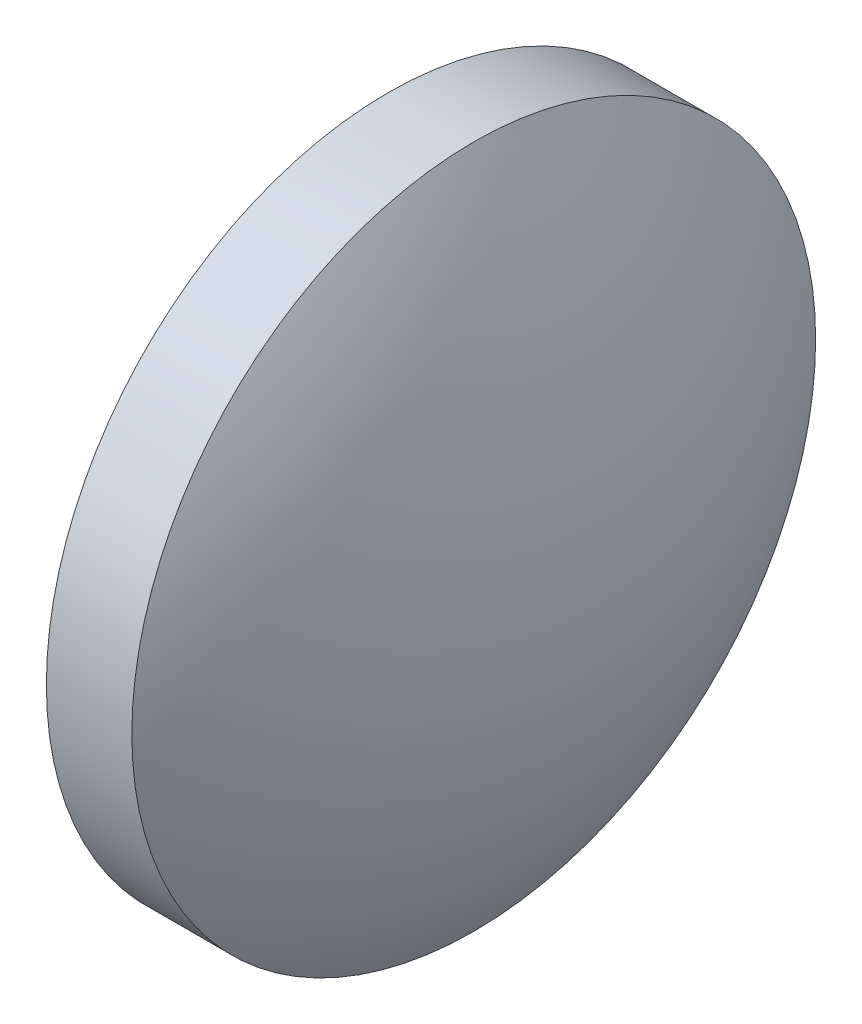
ISO-10303-21;
HEADER;
FILE_DESCRIPTION(('STEP AP214'),'2;1');
FILE_NAME('part.step','',(''),(''),'','','');
FILE_SCHEMA(('AUTOMOTIVE_DESIGN { 1 0 10303 214 1 1 1 1 }'));
ENDSEC;
DATA;
#1=APPLICATION_CONTEXT('core data for automotive mechanical design processes');
#2=APPLICATION_PROTOCOL_DEFINITION('international standard','automotive_design',2000,#1);
#3=PRODUCT_CONTEXT('',#1,'mechanical');
#4=PRODUCT('Part','Part','',(#3));
#5=PRODUCT_RELATED_PRODUCT_CATEGORY('part','',(#4));
#6=PRODUCT_DEFINITION_FORMATION('','',#4);
#7=PRODUCT_DEFINITION_CONTEXT('part definition',#1,'design');
#8=PRODUCT_DEFINITION('design','',#6,#7);
#9=PRODUCT_DEFINITION_SHAPE('','',#8);
#10=(LENGTH_UNIT() NAMED_UNIT(*) SI_UNIT(.MILLI.,.METRE.));
#11=(NAMED_UNIT(*) PLANE_ANGLE_UNIT() SI_UNIT($,.RADIAN.));
#12=(NAMED_UNIT(*) SI_UNIT($,.STERADIAN.) SOLID_ANGLE_UNIT());
#13=UNCERTAINTY_MEASURE_WITH_UNIT(LENGTH_MEASURE(1.E-05),#10,'distance_accuracy_value','');
#14=(GEOMETRIC_REPRESENTATION_CONTEXT(3) GLOBAL_UNCERTAINTY_ASSIGNED_CONTEXT((#13)) GLOBAL_UNIT_ASSIGNED_CONTEXT((#10,
#11,#12)) REPRESENTATION_CONTEXT('',''));
#15=CARTESIAN_POINT('',(0.,0.,0.));
#16=DIRECTION('',(0.,0.,1.));
#17=DIRECTION('',(1.,0.,0.));
#18=AXIS2_PLACEMENT_3D('',#15,#16,#17);
#19=CARTESIAN_POINT('',(66.525080524827,30.6243231642109,0.));
#20=DIRECTION('',(-1.,0.,0.));
#21=DIRECTION('',(0.,1.,0.));
#22=AXIS2_PLACEMENT_3D('',#19,#20,#21);
#23=SPHERICAL_SURFACE('',#22,15.3182204642972);
#24=CARTESIAN_POINT('',(53.4618543462441,30.6243231642109,0.));
#25=DIRECTION('',(-1.,0.,0.));
#26=DIRECTION('',(0.,-1.,0.));
#27=AXIS2_PLACEMENT_3D('',#24,#25,#26);
#28=CIRCLE('',#27,7.99999999999998);
#29=CARTESIAN_POINT('',(53.4618543462441,22.6243231642109,0.));
#30=VERTEX_POINT('',#29);
#31=EDGE_CURVE('E46',#30,#30,#28,.T.);
#32=ORIENTED_EDGE('',*,*,#31,.T.);
#33=EDGE_LOOP('',(#32));
#34=FACE_BOUND('',#33,.T.);
#35=ADVANCED_FACE('F39',(#34),#23,.T.);
#36=CARTESIAN_POINT('',(42.3986281676611,30.6243231642109,0.));
#37=DIRECTION('',(-1.,0.,0.));
#38=DIRECTION('',(0.,-1.,0.));
#39=AXIS2_PLACEMENT_3D('',#36,#37,#38);
#40=SPHERICAL_SURFACE('',#39,15.3182204642972);
#41=CARTESIAN_POINT('',(55.4618543462441,30.6243231642109,0.));
#42=DIRECTION('',(-1.,0.,0.));
#43=DIRECTION('',(0.,-1.,0.));
#44=AXIS2_PLACEMENT_3D('',#41,#42,#43);
#45=CIRCLE('',#44,7.99999999999997);
#46=CARTESIAN_POINT('',(55.4618543462441,22.6243231642109,0.));
#47=VERTEX_POINT('',#46);
#48=EDGE_CURVE('E10',#47,#47,#45,.T.);
#49=ORIENTED_EDGE('',*,*,#48,.F.);
#50=EDGE_LOOP('',(#49));
#51=FACE_BOUND('',#50,.T.);
#52=ADVANCED_FACE('F56',(#51),#40,.T.);
#53=CARTESIAN_POINT('',(49.5764558869757,30.6243231642109,0.));
#54=DIRECTION('',(-1.,0.,0.));
#55=DIRECTION('',(0.,-1.,0.));
#56=AXIS2_PLACEMENT_3D('',#53,#54,#55);
#57=CYLINDRICAL_SURFACE('',#56,7.99999999999998);
#58=ORIENTED_EDGE('',*,*,#48,.T.);
#59=EDGE_LOOP('',(#58));
#60=FACE_BOUND('',#59,.T.);
#61=ORIENTED_EDGE('',*,*,#31,.F.);
#62=EDGE_LOOP('',(#61));
#63=FACE_BOUND('',#62,.T.);
#64=ADVANCED_FACE('F54',(#60,#63),#57,.T.);
#65=CLOSED_SHELL('',(#35,#52,#64));
#66=MANIFOLD_SOLID_BREP('B2',#65);
#67=ADVANCED_BREP_SHAPE_REPRESENTATION('',(#18,#66),#14);
#68=SHAPE_DEFINITION_REPRESENTATION(#9,#67);
ENDSEC;
END-ISO-10303-21;
